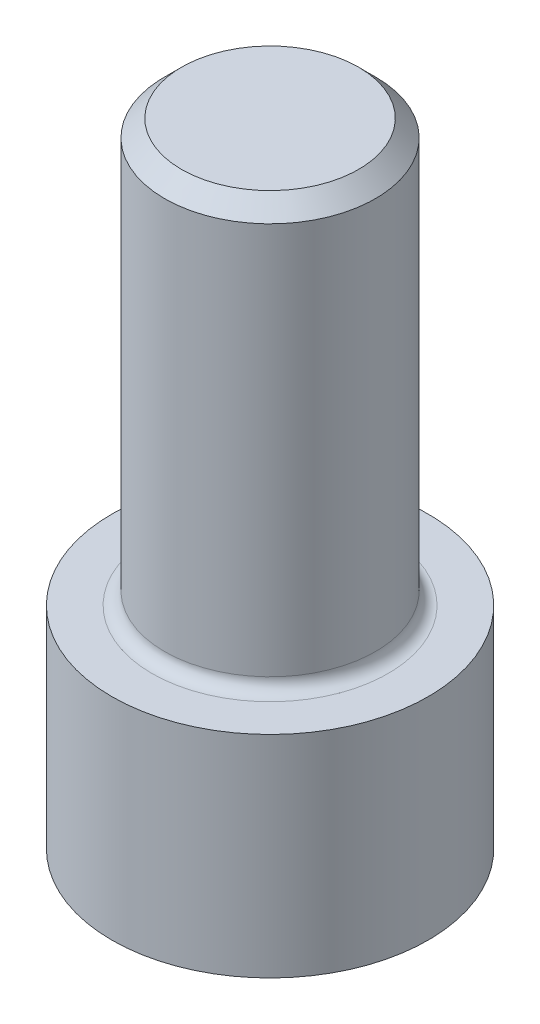
ISO-10303-21;
HEADER;
FILE_DESCRIPTION(('STEP AP214'),'2;1');
FILE_NAME('part.step','',(''),(''),'','','');
FILE_SCHEMA(('AUTOMOTIVE_DESIGN { 1 0 10303 214 1 1 1 1 }'));
ENDSEC;
DATA;
#1=APPLICATION_CONTEXT('core data for automotive mechanical design processes');
#2=APPLICATION_PROTOCOL_DEFINITION('international standard','automotive_design',2000,#1);
#3=PRODUCT_CONTEXT('',#1,'mechanical');
#4=PRODUCT('Part','Part','',(#3));
#5=PRODUCT_RELATED_PRODUCT_CATEGORY('part','',(#4));
#6=PRODUCT_DEFINITION_FORMATION('','',#4);
#7=PRODUCT_DEFINITION_CONTEXT('part definition',#1,'design');
#8=PRODUCT_DEFINITION('design','',#6,#7);
#9=PRODUCT_DEFINITION_SHAPE('','',#8);
#10=(LENGTH_UNIT() NAMED_UNIT(*) SI_UNIT(.MILLI.,.METRE.));
#11=(NAMED_UNIT(*) PLANE_ANGLE_UNIT() SI_UNIT($,.RADIAN.));
#12=(NAMED_UNIT(*) SI_UNIT($,.STERADIAN.) SOLID_ANGLE_UNIT());
#13=UNCERTAINTY_MEASURE_WITH_UNIT(LENGTH_MEASURE(1.E-05),#10,'distance_accuracy_value','');
#14=(GEOMETRIC_REPRESENTATION_CONTEXT(3) GLOBAL_UNCERTAINTY_ASSIGNED_CONTEXT((#13)) GLOBAL_UNIT_ASSIGNED_CONTEXT((#10,
#11,#12)) REPRESENTATION_CONTEXT('',''));
#15=CARTESIAN_POINT('',(0.,0.,0.));
#16=DIRECTION('',(0.,0.,1.));
#17=DIRECTION('',(1.,0.,0.));
#18=AXIS2_PLACEMENT_3D('',#15,#16,#17);
#19=CARTESIAN_POINT('',(0.,6.35,0.));
#20=DIRECTION('',(0.,-1.,0.));
#21=DIRECTION('',(0.,0.,-1.));
#22=AXIS2_PLACEMENT_3D('',#19,#20,#21);
#23=CYLINDRICAL_SURFACE('',#22,4.7625);
#24=CARTESIAN_POINT('',(0.,6.35,0.));
#25=DIRECTION('',(0.,1.,0.));
#26=DIRECTION('',(0.,0.,1.));
#27=AXIS2_PLACEMENT_3D('',#24,#25,#26);
#28=CIRCLE('',#27,4.7625);
#29=CARTESIAN_POINT('',(0.,6.35,4.7625));
#30=VERTEX_POINT('',#29);
#31=EDGE_CURVE('E144',#30,#30,#28,.T.);
#32=ORIENTED_EDGE('',*,*,#31,.F.);
#33=EDGE_LOOP('',(#32));
#34=FACE_BOUND('',#33,.T.);
#35=CARTESIAN_POINT('',(0.,0.,0.));
#36=DIRECTION('',(0.,1.,0.));
#37=DIRECTION('',(0.,0.,1.));
#38=AXIS2_PLACEMENT_3D('',#35,#36,#37);
#39=CIRCLE('',#38,4.7625);
#40=CARTESIAN_POINT('',(0.,0.,4.7625));
#41=VERTEX_POINT('',#40);
#42=EDGE_CURVE('E138',#41,#41,#39,.T.);
#43=ORIENTED_EDGE('',*,*,#42,.T.);
#44=EDGE_LOOP('',(#43));
#45=FACE_BOUND('',#44,.T.);
#46=ADVANCED_FACE('F35',(#34,#45),#23,.T.);
#47=CARTESIAN_POINT('',(0.,6.35,0.));
#48=DIRECTION('',(0.,1.,0.));
#49=DIRECTION('',(0.,0.,1.));
#50=AXIS2_PLACEMENT_3D('',#47,#48,#49);
#51=PLANE('',#50);
#52=CARTESIAN_POINT('',(0.,6.35,0.));
#53=DIRECTION('',(0.,1.,0.));
#54=DIRECTION('',(0.,0.,1.));
#55=AXIS2_PLACEMENT_3D('',#52,#53,#54);
#56=CIRCLE('',#55,3.556);
#57=CARTESIAN_POINT('',(0.,6.35,3.556));
#58=VERTEX_POINT('',#57);
#59=EDGE_CURVE('E152',#58,#58,#56,.F.);
#60=ORIENTED_EDGE('',*,*,#59,.T.);
#61=EDGE_LOOP('',(#60));
#62=FACE_BOUND('',#61,.T.);
#63=ORIENTED_EDGE('',*,*,#31,.T.);
#64=EDGE_LOOP('',(#63));
#65=FACE_BOUND('',#64,.T.);
#66=ADVANCED_FACE('F168',(#62,#65),#51,.T.);
#67=CARTESIAN_POINT('',(0.,0.,0.));
#68=DIRECTION('',(0.,1.,0.));
#69=DIRECTION('',(0.,0.,1.));
#70=AXIS2_PLACEMENT_3D('',#67,#68,#69);
#71=PLANE('',#70);
#72=DIRECTION('',(-0.5,0.,0.866025403784439));
#73=VECTOR('',#72,1.);
#74=CARTESIAN_POINT('',(2.54,0.,0.));
#75=LINE('',#74,#73);
#76=CARTESIAN_POINT('',(2.54,0.,0.));
#77=VERTEX_POINT('',#76);
#78=CARTESIAN_POINT('',(1.27,0.,2.19970452561248));
#79=VERTEX_POINT('',#78);
#80=EDGE_CURVE('E125',#77,#79,#75,.T.);
#81=ORIENTED_EDGE('',*,*,#80,.F.);
#82=DIRECTION('',(0.5,0.,0.866025403784439));
#83=VECTOR('',#82,1.);
#84=CARTESIAN_POINT('',(1.27,0.,-2.19970452561247));
#85=LINE('',#84,#83);
#86=CARTESIAN_POINT('',(1.27,0.,-2.19970452561247));
#87=VERTEX_POINT('',#86);
#88=EDGE_CURVE('E51',#87,#77,#85,.T.);
#89=ORIENTED_EDGE('',*,*,#88,.F.);
#90=DIRECTION('',(1.,0.,0.));
#91=VECTOR('',#90,1.);
#92=CARTESIAN_POINT('',(-1.27,0.,-2.19970452561247));
#93=LINE('',#92,#91);
#94=CARTESIAN_POINT('',(-1.27,0.,-2.19970452561247));
#95=VERTEX_POINT('',#94);
#96=EDGE_CURVE('E134',#95,#87,#93,.T.);
#97=ORIENTED_EDGE('',*,*,#96,.F.);
#98=DIRECTION('',(0.5,0.,-0.866025403784439));
#99=VECTOR('',#98,1.);
#100=CARTESIAN_POINT('',(-2.54,0.,0.));
#101=LINE('',#100,#99);
#102=CARTESIAN_POINT('',(-2.54,0.,0.));
#103=VERTEX_POINT('',#102);
#104=EDGE_CURVE('E132',#103,#95,#101,.T.);
#105=ORIENTED_EDGE('',*,*,#104,.F.);
#106=DIRECTION('',(-0.5,0.,-0.866025403784439));
#107=VECTOR('',#106,1.);
#108=CARTESIAN_POINT('',(-1.27,0.,2.19970452561247));
#109=LINE('',#108,#107);
#110=CARTESIAN_POINT('',(-1.27,0.,2.19970452561247));
#111=VERTEX_POINT('',#110);
#112=EDGE_CURVE('E99',#111,#103,#109,.T.);
#113=ORIENTED_EDGE('',*,*,#112,.F.);
#114=DIRECTION('',(-1.,0.,0.));
#115=VECTOR('',#114,1.);
#116=CARTESIAN_POINT('',(1.27,0.,2.19970452561248));
#117=LINE('',#116,#115);
#118=EDGE_CURVE('E128',#79,#111,#117,.T.);
#119=ORIENTED_EDGE('',*,*,#118,.F.);
#120=EDGE_LOOP('',(#81,#89,#97,#105,#113,#119));
#121=FACE_BOUND('',#120,.T.);
#122=ORIENTED_EDGE('',*,*,#42,.F.);
#123=EDGE_LOOP('',(#122));
#124=FACE_BOUND('',#123,.T.);
#125=ADVANCED_FACE('F174',(#121,#124),#71,.F.);
#126=CARTESIAN_POINT('',(1.27,3.81,-2.19970452561247));
#127=DIRECTION('',(0.866025403784439,0.,-0.5));
#128=DIRECTION('',(-0.5,0.,-0.866025403784439));
#129=AXIS2_PLACEMENT_3D('',#126,#127,#128);
#130=PLANE('',#129);
#131=ORIENTED_EDGE('',*,*,#88,.T.);
#132=DIRECTION('',(0.,-1.,0.));
#133=VECTOR('',#132,1.);
#134=CARTESIAN_POINT('',(2.54,3.81,0.));
#135=LINE('',#134,#133);
#136=CARTESIAN_POINT('',(2.54,3.81,0.));
#137=VERTEX_POINT('',#136);
#138=EDGE_CURVE('E81',#137,#77,#135,.T.);
#139=ORIENTED_EDGE('',*,*,#138,.F.);
#140=DIRECTION('',(0.5,0.,0.866025403784439));
#141=VECTOR('',#140,1.);
#142=CARTESIAN_POINT('',(1.27,3.81,-2.19970452561247));
#143=LINE('',#142,#141);
#144=CARTESIAN_POINT('',(1.27,3.81,-2.19970452561247));
#145=VERTEX_POINT('',#144);
#146=EDGE_CURVE('E136',#145,#137,#143,.T.);
#147=ORIENTED_EDGE('',*,*,#146,.F.);
#148=DIRECTION('',(0.,-1.,0.));
#149=VECTOR('',#148,1.);
#150=CARTESIAN_POINT('',(1.27,3.81,-2.19970452561247));
#151=LINE('',#150,#149);
#152=EDGE_CURVE('E59',#145,#87,#151,.T.);
#153=ORIENTED_EDGE('',*,*,#152,.T.);
#154=EDGE_LOOP('',(#131,#139,#147,#153));
#155=FACE_BOUND('',#154,.T.);
#156=ADVANCED_FACE('F181',(#155),#130,.F.);
#157=CARTESIAN_POINT('',(-1.27,3.81,-2.19970452561247));
#158=DIRECTION('',(0.,0.,-1.));
#159=DIRECTION('',(-1.,0.,0.));
#160=AXIS2_PLACEMENT_3D('',#157,#158,#159);
#161=PLANE('',#160);
#162=ORIENTED_EDGE('',*,*,#96,.T.);
#163=ORIENTED_EDGE('',*,*,#152,.F.);
#164=DIRECTION('',(1.,0.,0.));
#165=VECTOR('',#164,1.);
#166=CARTESIAN_POINT('',(-1.27,3.81,-2.19970452561247));
#167=LINE('',#166,#165);
#168=CARTESIAN_POINT('',(-1.27,3.81,-2.19970452561247));
#169=VERTEX_POINT('',#168);
#170=EDGE_CURVE('E111',#169,#145,#167,.T.);
#171=ORIENTED_EDGE('',*,*,#170,.F.);
#172=DIRECTION('',(0.,-1.,0.));
#173=VECTOR('',#172,1.);
#174=CARTESIAN_POINT('',(-1.27,3.81,-2.19970452561247));
#175=LINE('',#174,#173);
#176=EDGE_CURVE('E103',#169,#95,#175,.T.);
#177=ORIENTED_EDGE('',*,*,#176,.T.);
#178=EDGE_LOOP('',(#162,#163,#171,#177));
#179=FACE_BOUND('',#178,.T.);
#180=ADVANCED_FACE('F186',(#179),#161,.F.);
#181=CARTESIAN_POINT('',(-2.54,3.81,0.));
#182=DIRECTION('',(-0.866025403784439,0.,-0.5));
#183=DIRECTION('',(-0.5,0.,0.866025403784439));
#184=AXIS2_PLACEMENT_3D('',#181,#182,#183);
#185=PLANE('',#184);
#186=ORIENTED_EDGE('',*,*,#104,.T.);
#187=ORIENTED_EDGE('',*,*,#176,.F.);
#188=DIRECTION('',(0.5,0.,-0.866025403784439));
#189=VECTOR('',#188,1.);
#190=CARTESIAN_POINT('',(-2.54,3.81,0.));
#191=LINE('',#190,#189);
#192=CARTESIAN_POINT('',(-2.54,3.81,0.));
#193=VERTEX_POINT('',#192);
#194=EDGE_CURVE('E107',#193,#169,#191,.T.);
#195=ORIENTED_EDGE('',*,*,#194,.F.);
#196=DIRECTION('',(0.,-1.,0.));
#197=VECTOR('',#196,1.);
#198=CARTESIAN_POINT('',(-2.54,3.81,0.));
#199=LINE('',#198,#197);
#200=EDGE_CURVE('E92',#193,#103,#199,.T.);
#201=ORIENTED_EDGE('',*,*,#200,.T.);
#202=EDGE_LOOP('',(#186,#187,#195,#201));
#203=FACE_BOUND('',#202,.T.);
#204=ADVANCED_FACE('F108',(#203),#185,.F.);
#205=CARTESIAN_POINT('',(-1.27,3.81,2.19970452561247));
#206=DIRECTION('',(-0.866025403784439,0.,0.5));
#207=DIRECTION('',(0.5,0.,0.866025403784439));
#208=AXIS2_PLACEMENT_3D('',#205,#206,#207);
#209=PLANE('',#208);
#210=ORIENTED_EDGE('',*,*,#112,.T.);
#211=ORIENTED_EDGE('',*,*,#200,.F.);
#212=DIRECTION('',(-0.5,0.,-0.866025403784439));
#213=VECTOR('',#212,1.);
#214=CARTESIAN_POINT('',(-1.27,3.81,2.19970452561247));
#215=LINE('',#214,#213);
#216=CARTESIAN_POINT('',(-1.27,3.81,2.19970452561247));
#217=VERTEX_POINT('',#216);
#218=EDGE_CURVE('E96',#217,#193,#215,.T.);
#219=ORIENTED_EDGE('',*,*,#218,.F.);
#220=DIRECTION('',(0.,-1.,0.));
#221=VECTOR('',#220,1.);
#222=CARTESIAN_POINT('',(-1.27,3.81,2.19970452561247));
#223=LINE('',#222,#221);
#224=EDGE_CURVE('E104',#217,#111,#223,.T.);
#225=ORIENTED_EDGE('',*,*,#224,.T.);
#226=EDGE_LOOP('',(#210,#211,#219,#225));
#227=FACE_BOUND('',#226,.T.);
#228=ADVANCED_FACE('F94',(#227),#209,.F.);
#229=CARTESIAN_POINT('',(1.27,3.81,2.19970452561248));
#230=DIRECTION('',(0.,0.,1.));
#231=DIRECTION('',(1.,0.,0.));
#232=AXIS2_PLACEMENT_3D('',#229,#230,#231);
#233=PLANE('',#232);
#234=ORIENTED_EDGE('',*,*,#118,.T.);
#235=ORIENTED_EDGE('',*,*,#224,.F.);
#236=DIRECTION('',(-1.,0.,0.));
#237=VECTOR('',#236,1.);
#238=CARTESIAN_POINT('',(1.27,3.81,2.19970452561248));
#239=LINE('',#238,#237);
#240=CARTESIAN_POINT('',(1.27,3.81,2.19970452561248));
#241=VERTEX_POINT('',#240);
#242=EDGE_CURVE('E117',#241,#217,#239,.T.);
#243=ORIENTED_EDGE('',*,*,#242,.F.);
#244=DIRECTION('',(0.,-1.,0.));
#245=VECTOR('',#244,1.);
#246=CARTESIAN_POINT('',(1.27,3.81,2.19970452561248));
#247=LINE('',#246,#245);
#248=EDGE_CURVE('E141',#241,#79,#247,.T.);
#249=ORIENTED_EDGE('',*,*,#248,.T.);
#250=EDGE_LOOP('',(#234,#235,#243,#249));
#251=FACE_BOUND('',#250,.T.);
#252=ADVANCED_FACE('F190',(#251),#233,.F.);
#253=CARTESIAN_POINT('',(2.54,3.81,0.));
#254=DIRECTION('',(0.866025403784439,0.,0.5));
#255=DIRECTION('',(0.5,0.,-0.866025403784439));
#256=AXIS2_PLACEMENT_3D('',#253,#254,#255);
#257=PLANE('',#256);
#258=ORIENTED_EDGE('',*,*,#80,.T.);
#259=ORIENTED_EDGE('',*,*,#248,.F.);
#260=DIRECTION('',(-0.5,0.,0.866025403784439));
#261=VECTOR('',#260,1.);
#262=CARTESIAN_POINT('',(2.54,3.81,0.));
#263=LINE('',#262,#261);
#264=EDGE_CURVE('E119',#137,#241,#263,.T.);
#265=ORIENTED_EDGE('',*,*,#264,.F.);
#266=ORIENTED_EDGE('',*,*,#138,.T.);
#267=EDGE_LOOP('',(#258,#259,#265,#266));
#268=FACE_BOUND('',#267,.T.);
#269=ADVANCED_FACE('F187',(#268),#257,.F.);
#270=CARTESIAN_POINT('',(0.,3.81,0.));
#271=DIRECTION('',(0.,-1.,0.));
#272=DIRECTION('',(0.,0.,-1.));
#273=AXIS2_PLACEMENT_3D('',#270,#271,#272);
#274=PLANE('',#273);
#275=ORIENTED_EDGE('',*,*,#146,.T.);
#276=ORIENTED_EDGE('',*,*,#264,.T.);
#277=ORIENTED_EDGE('',*,*,#242,.T.);
#278=ORIENTED_EDGE('',*,*,#218,.T.);
#279=ORIENTED_EDGE('',*,*,#194,.T.);
#280=ORIENTED_EDGE('',*,*,#170,.T.);
#281=EDGE_LOOP('',(#275,#276,#277,#278,#279,#280));
#282=FACE_BOUND('',#281,.T.);
#283=ADVANCED_FACE('F114',(#282),#274,.T.);
#284=CARTESIAN_POINT('',(0.,19.05,0.));
#285=DIRECTION('',(0.,-1.,0.));
#286=DIRECTION('',(0.,0.,-1.));
#287=AXIS2_PLACEMENT_3D('',#284,#285,#286);
#288=CYLINDRICAL_SURFACE('',#287,3.175);
#289=CARTESIAN_POINT('',(0.,18.542,0.));
#290=DIRECTION('',(0.,1.,0.));
#291=DIRECTION('',(0.,0.,1.));
#292=AXIS2_PLACEMENT_3D('',#289,#290,#291);
#293=CIRCLE('',#292,3.175);
#294=CARTESIAN_POINT('',(0.,18.542,3.175));
#295=VERTEX_POINT('',#294);
#296=EDGE_CURVE('E11',#295,#295,#293,.F.);
#297=ORIENTED_EDGE('',*,*,#296,.T.);
#298=EDGE_LOOP('',(#297));
#299=FACE_BOUND('',#298,.T.);
#300=CARTESIAN_POINT('',(0.,6.731,0.));
#301=DIRECTION('',(0.,1.,0.));
#302=DIRECTION('',(0.,0.,1.));
#303=AXIS2_PLACEMENT_3D('',#300,#301,#302);
#304=CIRCLE('',#303,3.175);
#305=CARTESIAN_POINT('',(0.,6.731,3.175));
#306=VERTEX_POINT('',#305);
#307=EDGE_CURVE('E147',#306,#306,#304,.T.);
#308=ORIENTED_EDGE('',*,*,#307,.T.);
#309=EDGE_LOOP('',(#308));
#310=FACE_BOUND('',#309,.T.);
#311=ADVANCED_FACE('F203',(#299,#310),#288,.T.);
#312=CARTESIAN_POINT('',(0.,19.05,0.));
#313=DIRECTION('',(0.,1.,0.));
#314=DIRECTION('',(0.,0.,1.));
#315=AXIS2_PLACEMENT_3D('',#312,#313,#314);
#316=PLANE('',#315);
#317=CARTESIAN_POINT('',(0.,19.05,0.));
#318=DIRECTION('',(0.,1.,0.));
#319=DIRECTION('',(0.,0.,1.));
#320=AXIS2_PLACEMENT_3D('',#317,#318,#319);
#321=CIRCLE('',#320,2.667);
#322=CARTESIAN_POINT('',(0.,19.05,2.667));
#323=VERTEX_POINT('',#322);
#324=EDGE_CURVE('E44',#323,#323,#321,.T.);
#325=ORIENTED_EDGE('',*,*,#324,.T.);
#326=EDGE_LOOP('',(#325));
#327=FACE_BOUND('',#326,.T.);
#328=ADVANCED_FACE('F157',(#327),#316,.T.);
#329=CARTESIAN_POINT('',(0.,6.731,0.));
#330=DIRECTION('',(0.,1.,0.));
#331=DIRECTION('',(0.,0.,1.));
#332=AXIS2_PLACEMENT_3D('',#329,#330,#331);
#333=TOROIDAL_SURFACE('',#332,3.556,0.381);
#334=ORIENTED_EDGE('',*,*,#59,.F.);
#335=EDGE_LOOP('',(#334));
#336=FACE_BOUND('',#335,.T.);
#337=ORIENTED_EDGE('',*,*,#307,.F.);
#338=EDGE_LOOP('',(#337));
#339=FACE_BOUND('',#338,.T.);
#340=ADVANCED_FACE('F160',(#336,#339),#333,.F.);
#341=CARTESIAN_POINT('',(0.,19.05,0.));
#342=DIRECTION('',(0.,-1.,0.));
#343=DIRECTION('',(0.,0.,-1.));
#344=AXIS2_PLACEMENT_3D('',#341,#342,#343);
#345=CONICAL_SURFACE('',#344,2.667,0.785398163397444);
#346=ORIENTED_EDGE('',*,*,#296,.F.);
#347=EDGE_LOOP('',(#346));
#348=FACE_BOUND('',#347,.T.);
#349=ORIENTED_EDGE('',*,*,#324,.F.);
#350=EDGE_LOOP('',(#349));
#351=FACE_BOUND('',#350,.T.);
#352=ADVANCED_FACE('F38',(#348,#351),#345,.T.);
#353=CLOSED_SHELL('',(#46,#66,#125,#156,#180,#204,#228,#252,#269,#283,#311,#328,#340,#352));
#354=MANIFOLD_SOLID_BREP('B2',#353);
#355=ADVANCED_BREP_SHAPE_REPRESENTATION('',(#18,#354),#14);
#356=SHAPE_DEFINITION_REPRESENTATION(#9,#355);
ENDSEC;
END-ISO-10303-21;
